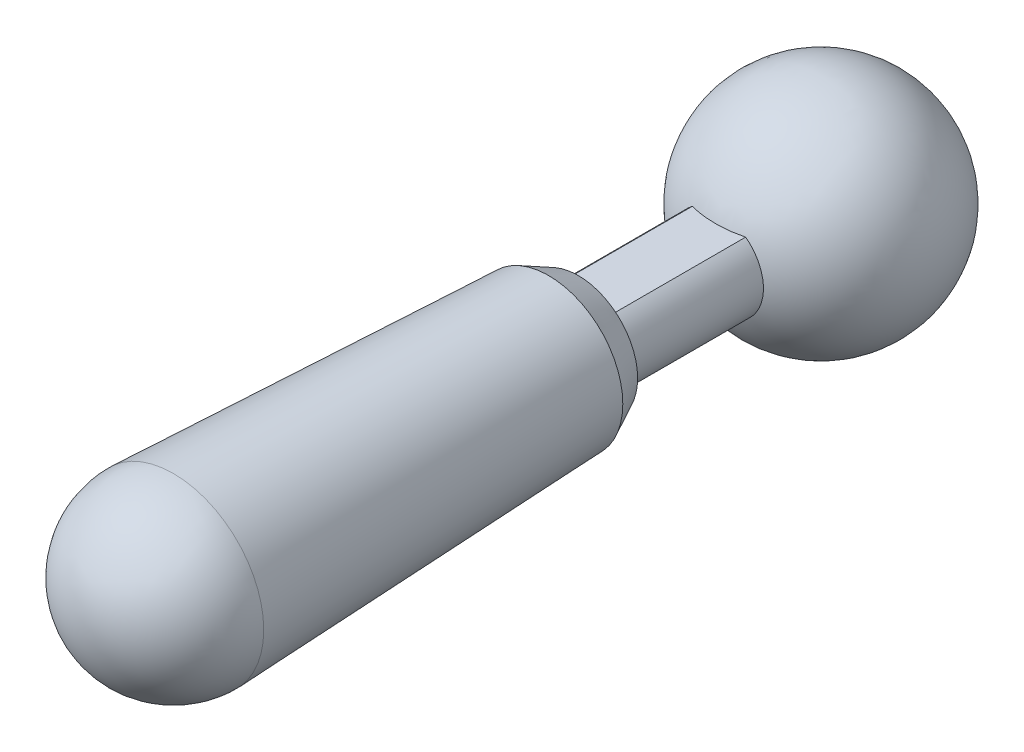
ISO-10303-21;
HEADER;
FILE_DESCRIPTION(('STEP AP214'),'2;1');
FILE_NAME('part.step','',(''),(''),'','','');
FILE_SCHEMA(('AUTOMOTIVE_DESIGN { 1 0 10303 214 1 1 1 1 }'));
ENDSEC;
DATA;
#1=APPLICATION_CONTEXT('core data for automotive mechanical design processes');
#2=APPLICATION_PROTOCOL_DEFINITION('international standard','automotive_design',2000,#1);
#3=PRODUCT_CONTEXT('',#1,'mechanical');
#4=PRODUCT('Part','Part','',(#3));
#5=PRODUCT_RELATED_PRODUCT_CATEGORY('part','',(#4));
#6=PRODUCT_DEFINITION_FORMATION('','',#4);
#7=PRODUCT_DEFINITION_CONTEXT('part definition',#1,'design');
#8=PRODUCT_DEFINITION('design','',#6,#7);
#9=PRODUCT_DEFINITION_SHAPE('','',#8);
#10=(LENGTH_UNIT() NAMED_UNIT(*) SI_UNIT(.MILLI.,.METRE.));
#11=(NAMED_UNIT(*) PLANE_ANGLE_UNIT() SI_UNIT($,.RADIAN.));
#12=(NAMED_UNIT(*) SI_UNIT($,.STERADIAN.) SOLID_ANGLE_UNIT());
#13=UNCERTAINTY_MEASURE_WITH_UNIT(LENGTH_MEASURE(1.E-05),#10,'distance_accuracy_value','');
#14=(GEOMETRIC_REPRESENTATION_CONTEXT(3) GLOBAL_UNCERTAINTY_ASSIGNED_CONTEXT((#13)) GLOBAL_UNIT_ASSIGNED_CONTEXT((#10,
#11,#12)) REPRESENTATION_CONTEXT('',''));
#15=CARTESIAN_POINT('',(0.,0.,0.));
#16=DIRECTION('',(0.,0.,1.));
#17=DIRECTION('',(1.,0.,0.));
#18=AXIS2_PLACEMENT_3D('',#15,#16,#17);
#19=CARTESIAN_POINT('',(0.,0.,0.));
#20=DIRECTION('',(1.,0.,0.));
#21=DIRECTION('',(0.,1.,0.));
#22=AXIS2_PLACEMENT_3D('',#19,#20,#21);
#23=SPHERICAL_SURFACE('',#22,3.75);
#24=CARTESIAN_POINT('',(-3.75,0.,0.));
#25=VERTEX_POINT('',#24);
#26=VERTEX_LOOP('',#25);
#27=FACE_BOUND('',#26,.T.);
#28=CARTESIAN_POINT('',(3.75,0.,0.));
#29=VERTEX_POINT('',#28);
#30=VERTEX_LOOP('',#29);
#31=FACE_BOUND('',#30,.T.);
#32=CARTESIAN_POINT('',(-0.9,-1.2,3.43693177121688));
#33=CARTESIAN_POINT('',(-0.802359849892506,-1.2,3.46251160449941));
#34=CARTESIAN_POINT('',(-0.703625180885471,-1.2,3.48390886694935));
#35=CARTESIAN_POINT('',(-0.504662757165129,-1.2,3.51823653642531));
#36=CARTESIAN_POINT('',(-0.404434545767016,-1.2,3.5311642970241));
#37=CARTESIAN_POINT('',(-0.205361379386467,-1.2,3.54825327924739));
#38=CARTESIAN_POINT('',(-0.106531745028381,-1.2,3.55259338586001));
#39=CARTESIAN_POINT('',(0.0911022215741666,-1.2,3.55302143144907));
#40=CARTESIAN_POINT('',(0.189906546310158,-1.2,3.54911293386561));
#41=CARTESIAN_POINT('',(0.390995963007708,-1.2,3.53273492266844));
#42=CARTESIAN_POINT('',(0.493252402910054,-1.2,3.51991179768711));
#43=CARTESIAN_POINT('',(0.697405465236371,-1.2,3.48525313294954));
#44=CARTESIAN_POINT('',(0.799285228247207,-1.2,3.46331825474848));
#45=CARTESIAN_POINT('',(0.9,-1.2,3.43693177121688));
#46=B_SPLINE_CURVE_WITH_KNOTS('',3,(#32,#33,#34,#35,#36,#37,#38,#39,#40,#41,#42,#43,#44,#45),
.UNSPECIFIED.,.F.,.F.,(4,2,2,2,2,2,4),(0.,0.302713256716097,0.605521055828375,0.901951890474439,
1.19825469166557,1.50703616204699,1.81927626561315),.UNSPECIFIED.);
#47=CARTESIAN_POINT('',(-0.9,-1.2,3.43693177121688));
#48=VERTEX_POINT('',#47);
#49=CARTESIAN_POINT('',(0.9,-1.2,3.43693177121688));
#50=VERTEX_POINT('',#49);
#51=EDGE_CURVE('E66',#48,#50,#46,.T.);
#52=ORIENTED_EDGE('',*,*,#51,.F.);
#53=CARTESIAN_POINT('',(0.,0.,3.43693177121688));
#54=DIRECTION('',(0.,0.,1.));
#55=DIRECTION('',(1.,0.,0.));
#56=AXIS2_PLACEMENT_3D('',#53,#54,#55);
#57=CIRCLE('',#56,1.5);
#58=CARTESIAN_POINT('',(-0.900000000000002,1.2,3.43693177121688));
#59=VERTEX_POINT('',#58);
#60=EDGE_CURVE('E87',#59,#48,#57,.T.);
#61=ORIENTED_EDGE('',*,*,#60,.F.);
#62=CARTESIAN_POINT('',(0.9,1.2,3.43693177121688));
#63=CARTESIAN_POINT('',(0.802359849892507,1.2,3.46251160449941));
#64=CARTESIAN_POINT('',(0.703625180885471,1.2,3.48390886694935));
#65=CARTESIAN_POINT('',(0.504662757165129,1.2,3.51823653642531));
#66=CARTESIAN_POINT('',(0.404434545767016,1.2,3.5311642970241));
#67=CARTESIAN_POINT('',(0.205361379386467,1.2,3.54825327924739));
#68=CARTESIAN_POINT('',(0.10653174502838,1.2,3.55259338586001));
#69=CARTESIAN_POINT('',(-0.0911022215741669,1.2,3.55302143144907));
#70=CARTESIAN_POINT('',(-0.189906546310158,1.2,3.54911293386561));
#71=CARTESIAN_POINT('',(-0.390995963007709,1.2,3.53273492266844));
#72=CARTESIAN_POINT('',(-0.493252402910055,1.2,3.51991179768711));
#73=CARTESIAN_POINT('',(-0.697405465236373,1.2,3.48525313294954));
#74=CARTESIAN_POINT('',(-0.799285228247209,1.2,3.46331825474847));
#75=CARTESIAN_POINT('',(-0.900000000000002,1.2,3.43693177121688));
#76=B_SPLINE_CURVE_WITH_KNOTS('',3,(#62,#63,#64,#65,#66,#67,#68,#69,#70,#71,#72,#73,#74,#75),
.UNSPECIFIED.,.F.,.F.,(4,2,2,2,2,2,4),(0.,0.302713256716097,0.605521055828376,0.90195189047444,
1.19825469166557,1.50703616204699,1.81927626561315),.UNSPECIFIED.);
#77=CARTESIAN_POINT('',(0.9,1.2,3.43693177121688));
#78=VERTEX_POINT('',#77);
#79=EDGE_CURVE('E69',#78,#59,#76,.T.);
#80=ORIENTED_EDGE('',*,*,#79,.F.);
#81=CARTESIAN_POINT('',(0.,0.,3.43693177121688));
#82=DIRECTION('',(0.,0.,1.));
#83=DIRECTION('',(1.,0.,0.));
#84=AXIS2_PLACEMENT_3D('',#81,#82,#83);
#85=CIRCLE('',#84,1.5);
#86=EDGE_CURVE('E22',#50,#78,#85,.T.);
#87=ORIENTED_EDGE('',*,*,#86,.F.);
#88=EDGE_LOOP('',(#52,#61,#80,#87));
#89=FACE_BOUND('',#88,.T.);
#90=ADVANCED_FACE('F17',(#27,#31,#89),#23,.T.);
#91=CARTESIAN_POINT('',(0.,0.,0.));
#92=DIRECTION('',(0.,0.,1.));
#93=DIRECTION('',(1.,0.,0.));
#94=AXIS2_PLACEMENT_3D('',#91,#92,#93);
#95=CYLINDRICAL_SURFACE('',#94,1.5);
#96=CARTESIAN_POINT('',(0.,0.,8.18));
#97=DIRECTION('',(0.,0.,1.));
#98=DIRECTION('',(1.,0.,0.));
#99=AXIS2_PLACEMENT_3D('',#96,#97,#98);
#100=CIRCLE('',#99,1.5);
#101=CARTESIAN_POINT('',(0.9,-1.2,8.18));
#102=VERTEX_POINT('',#101);
#103=CARTESIAN_POINT('',(0.9,1.2,8.18));
#104=VERTEX_POINT('',#103);
#105=EDGE_CURVE('E76',#102,#104,#100,.T.);
#106=ORIENTED_EDGE('',*,*,#105,.F.);
#107=DIRECTION('',(0.,0.,-1.));
#108=VECTOR('',#107,1.);
#109=CARTESIAN_POINT('',(0.9,-1.2,0.));
#110=LINE('',#109,#108);
#111=EDGE_CURVE('E73',#50,#102,#110,.F.);
#112=ORIENTED_EDGE('',*,*,#111,.F.);
#113=ORIENTED_EDGE('',*,*,#86,.T.);
#114=DIRECTION('',(0.,0.,1.));
#115=VECTOR('',#114,1.);
#116=CARTESIAN_POINT('',(0.9,1.2,0.));
#117=LINE('',#116,#115);
#118=EDGE_CURVE('E115',#104,#78,#117,.F.);
#119=ORIENTED_EDGE('',*,*,#118,.F.);
#120=EDGE_LOOP('',(#106,#112,#113,#119));
#121=FACE_BOUND('',#120,.T.);
#122=ADVANCED_FACE('F74',(#121),#95,.T.);
#123=CARTESIAN_POINT('',(-0.900000000000002,1.2,0.));
#124=DIRECTION('',(0.,1.,0.));
#125=DIRECTION('',(0.,0.,1.));
#126=AXIS2_PLACEMENT_3D('',#123,#124,#125);
#127=PLANE('',#126);
#128=DIRECTION('',(-1.,0.,0.));
#129=VECTOR('',#128,1.);
#130=CARTESIAN_POINT('',(1.,1.2,8.18));
#131=LINE('',#130,#129);
#132=CARTESIAN_POINT('',(-0.900000000000001,1.2,8.18));
#133=VERTEX_POINT('',#132);
#134=EDGE_CURVE('E127',#104,#133,#131,.T.);
#135=ORIENTED_EDGE('',*,*,#134,.F.);
#136=ORIENTED_EDGE('',*,*,#118,.T.);
#137=ORIENTED_EDGE('',*,*,#79,.T.);
#138=DIRECTION('',(0.,0.,1.));
#139=VECTOR('',#138,1.);
#140=CARTESIAN_POINT('',(-0.900000000000002,1.2,0.));
#141=LINE('',#140,#139);
#142=EDGE_CURVE('E84',#133,#59,#141,.F.);
#143=ORIENTED_EDGE('',*,*,#142,.F.);
#144=EDGE_LOOP('',(#135,#136,#137,#143));
#145=FACE_BOUND('',#144,.T.);
#146=ADVANCED_FACE('F106',(#145),#127,.T.);
#147=CARTESIAN_POINT('',(0.,0.,0.));
#148=DIRECTION('',(0.,0.,1.));
#149=DIRECTION('',(1.,0.,0.));
#150=AXIS2_PLACEMENT_3D('',#147,#148,#149);
#151=CYLINDRICAL_SURFACE('',#150,1.5);
#152=CARTESIAN_POINT('',(0.,0.,8.18));
#153=DIRECTION('',(0.,0.,1.));
#154=DIRECTION('',(1.,0.,0.));
#155=AXIS2_PLACEMENT_3D('',#152,#153,#154);
#156=CIRCLE('',#155,1.5);
#157=CARTESIAN_POINT('',(-0.9,-1.2,8.18));
#158=VERTEX_POINT('',#157);
#159=EDGE_CURVE('E125',#133,#158,#156,.T.);
#160=ORIENTED_EDGE('',*,*,#159,.F.);
#161=ORIENTED_EDGE('',*,*,#142,.T.);
#162=ORIENTED_EDGE('',*,*,#60,.T.);
#163=DIRECTION('',(0.,0.,-1.));
#164=VECTOR('',#163,1.);
#165=CARTESIAN_POINT('',(-0.9,-1.2,0.));
#166=LINE('',#165,#164);
#167=EDGE_CURVE('E80',#158,#48,#166,.T.);
#168=ORIENTED_EDGE('',*,*,#167,.F.);
#169=EDGE_LOOP('',(#160,#161,#162,#168));
#170=FACE_BOUND('',#169,.T.);
#171=ADVANCED_FACE('F102',(#170),#151,.T.);
#172=CARTESIAN_POINT('',(0.9,-1.2,0.));
#173=DIRECTION('',(0.,-1.,0.));
#174=DIRECTION('',(0.,0.,-1.));
#175=AXIS2_PLACEMENT_3D('',#172,#173,#174);
#176=PLANE('',#175);
#177=DIRECTION('',(-1.,0.,0.));
#178=VECTOR('',#177,1.);
#179=CARTESIAN_POINT('',(1.,-1.2,8.18));
#180=LINE('',#179,#178);
#181=EDGE_CURVE('E124',#158,#102,#180,.F.);
#182=ORIENTED_EDGE('',*,*,#181,.F.);
#183=ORIENTED_EDGE('',*,*,#167,.T.);
#184=ORIENTED_EDGE('',*,*,#51,.T.);
#185=ORIENTED_EDGE('',*,*,#111,.T.);
#186=EDGE_LOOP('',(#182,#183,#184,#185));
#187=FACE_BOUND('',#186,.T.);
#188=ADVANCED_FACE('F83',(#187),#176,.T.);
#189=CARTESIAN_POINT('',(1.,0.,8.18));
#190=DIRECTION('',(0.,0.,-1.));
#191=DIRECTION('',(-1.,0.,0.));
#192=AXIS2_PLACEMENT_3D('',#189,#190,#191);
#193=PLANE('',#192);
#194=ORIENTED_EDGE('',*,*,#159,.T.);
#195=ORIENTED_EDGE('',*,*,#181,.T.);
#196=ORIENTED_EDGE('',*,*,#105,.T.);
#197=ORIENTED_EDGE('',*,*,#134,.T.);
#198=EDGE_LOOP('',(#194,#195,#196,#197));
#199=FACE_BOUND('',#198,.T.);
#200=CARTESIAN_POINT('',(0.,0.,8.17999999986796));
#201=DIRECTION('',(0.,0.,1.));
#202=DIRECTION('',(1.,0.,0.));
#203=AXIS2_PLACEMENT_3D('',#200,#201,#202);
#204=CIRCLE('',#203,2.00000000026535);
#205=CARTESIAN_POINT('',(2.00000000026535,0.,8.17999999986796));
#206=VERTEX_POINT('',#205);
#207=EDGE_CURVE('E122',#206,#206,#204,.T.);
#208=ORIENTED_EDGE('',*,*,#207,.F.);
#209=EDGE_LOOP('',(#208));
#210=FACE_BOUND('',#209,.T.);
#211=ADVANCED_FACE('F101',(#199,#210),#193,.T.);
#212=CARTESIAN_POINT('',(0.,0.,21.835));
#213=DIRECTION('',(1.,0.,0.));
#214=DIRECTION('',(0.,1.,0.));
#215=AXIS2_PLACEMENT_3D('',#212,#213,#214);
#216=SPHERICAL_SURFACE('',#215,3.045);
#217=CARTESIAN_POINT('',(0.,0.,21.83500000001));
#218=DIRECTION('',(0.,0.,1.));
#219=DIRECTION('',(1.,0.,0.));
#220=AXIS2_PLACEMENT_3D('',#217,#218,#219);
#221=CIRCLE('',#220,3.04499999969379);
#222=CARTESIAN_POINT('',(-3.04499999969379,0.,21.83500000001));
#223=VERTEX_POINT('',#222);
#224=CARTESIAN_POINT('',(3.0449999996911,0.,21.83500000001));
#225=VERTEX_POINT('',#224);
#226=EDGE_CURVE('E28',#223,#225,#221,.F.);
#227=ORIENTED_EDGE('',*,*,#226,.F.);
#228=CARTESIAN_POINT('',(0.,0.,21.83500000001));
#229=DIRECTION('',(0.,0.,1.));
#230=DIRECTION('',(1.,0.,0.));
#231=AXIS2_PLACEMENT_3D('',#228,#229,#230);
#232=CIRCLE('',#231,3.0449999996911);
#233=EDGE_CURVE('E121',#225,#223,#232,.F.);
#234=ORIENTED_EDGE('',*,*,#233,.F.);
#235=EDGE_LOOP('',(#227,#234));
#236=FACE_BOUND('',#235,.T.);
#237=ADVANCED_FACE('F138',(#236),#216,.T.);
#238=CARTESIAN_POINT('',(0.,0.,9.17999999990116));
#239=DIRECTION('',(0.,0.,1.));
#240=DIRECTION('',(1.,0.,0.));
#241=AXIS2_PLACEMENT_3D('',#238,#239,#240);
#242=CONICAL_SURFACE('',#241,2.49999999962824,0.463647608477847);
#243=ORIENTED_EDGE('',*,*,#207,.T.);
#244=EDGE_LOOP('',(#243));
#245=FACE_BOUND('',#244,.T.);
#246=CARTESIAN_POINT('',(0.,0.,9.18000000001484));
#247=DIRECTION('',(0.,0.,1.));
#248=DIRECTION('',(1.,0.,0.));
#249=AXIS2_PLACEMENT_3D('',#246,#247,#248);
#250=CIRCLE('',#249,2.50000000031392);
#251=CARTESIAN_POINT('',(2.50000000031392,0.,9.18000000001484));
#252=VERTEX_POINT('',#251);
#253=EDGE_CURVE('E11',#252,#252,#250,.T.);
#254=ORIENTED_EDGE('',*,*,#253,.F.);
#255=EDGE_LOOP('',(#254));
#256=FACE_BOUND('',#255,.T.);
#257=ADVANCED_FACE('F141',(#245,#256),#242,.T.);
#258=CARTESIAN_POINT('',(0.,0.,21.8349999997827));
#259=DIRECTION('',(0.,0.,1.));
#260=DIRECTION('',(1.,0.,0.));
#261=AXIS2_PLACEMENT_3D('',#258,#259,#260);
#262=CONICAL_SURFACE('',#261,3.04499999968399,0.0430393868439957);
#263=ORIENTED_EDGE('',*,*,#253,.T.);
#264=EDGE_LOOP('',(#263));
#265=FACE_BOUND('',#264,.T.);
#266=ORIENTED_EDGE('',*,*,#226,.T.);
#267=ORIENTED_EDGE('',*,*,#233,.T.);
#268=EDGE_LOOP('',(#266,#267));
#269=FACE_BOUND('',#268,.T.);
#270=ADVANCED_FACE('F144',(#265,#269),#262,.T.);
#271=CLOSED_SHELL('',(#90,#122,#146,#171,#188,#211,#237,#257,#270));
#272=MANIFOLD_SOLID_BREP('B1',#271);
#273=ADVANCED_BREP_SHAPE_REPRESENTATION('',(#18,#272),#14);
#274=SHAPE_DEFINITION_REPRESENTATION(#9,#273);
ENDSEC;
END-ISO-10303-21;
